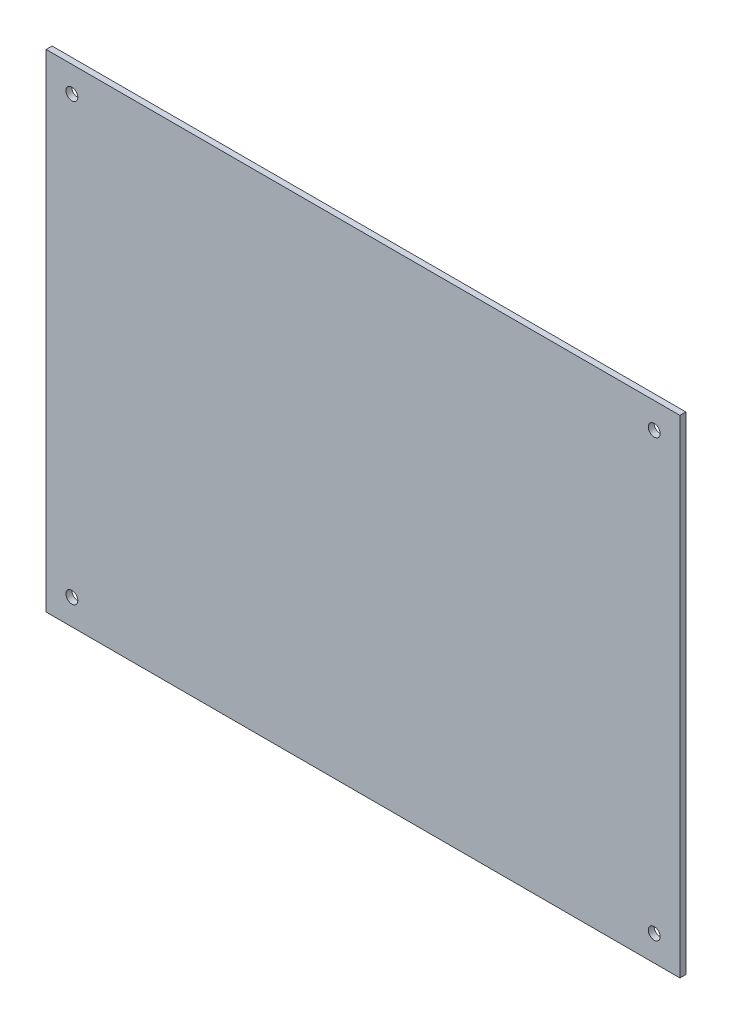
ISO-10303-21;
HEADER;
FILE_DESCRIPTION(('STEP AP214'),'2;1');
FILE_NAME('part.step','',(''),(''),'','','');
FILE_SCHEMA(('AUTOMOTIVE_DESIGN { 1 0 10303 214 1 1 1 1 }'));
ENDSEC;
DATA;
#1=APPLICATION_CONTEXT('core data for automotive mechanical design processes');
#2=APPLICATION_PROTOCOL_DEFINITION('international standard','automotive_design',2000,#1);
#3=PRODUCT_CONTEXT('',#1,'mechanical');
#4=PRODUCT('Part','Part','',(#3));
#5=PRODUCT_RELATED_PRODUCT_CATEGORY('part','',(#4));
#6=PRODUCT_DEFINITION_FORMATION('','',#4);
#7=PRODUCT_DEFINITION_CONTEXT('part definition',#1,'design');
#8=PRODUCT_DEFINITION('design','',#6,#7);
#9=PRODUCT_DEFINITION_SHAPE('','',#8);
#10=(LENGTH_UNIT() NAMED_UNIT(*) SI_UNIT(.MILLI.,.METRE.));
#11=(NAMED_UNIT(*) PLANE_ANGLE_UNIT() SI_UNIT($,.RADIAN.));
#12=(NAMED_UNIT(*) SI_UNIT($,.STERADIAN.) SOLID_ANGLE_UNIT());
#13=UNCERTAINTY_MEASURE_WITH_UNIT(LENGTH_MEASURE(1.E-05),#10,'distance_accuracy_value','');
#14=(GEOMETRIC_REPRESENTATION_CONTEXT(3) GLOBAL_UNCERTAINTY_ASSIGNED_CONTEXT((#13)) GLOBAL_UNIT_ASSIGNED_CONTEXT((#10,
#11,#12)) REPRESENTATION_CONTEXT('',''));
#15=CARTESIAN_POINT('',(0.,0.,0.));
#16=DIRECTION('',(0.,0.,1.));
#17=DIRECTION('',(1.,0.,0.));
#18=AXIS2_PLACEMENT_3D('',#15,#16,#17);
#19=CARTESIAN_POINT('',(1037.34751782577,-1519.02260067621,2.25));
#20=DIRECTION('',(0.,0.,1.));
#21=DIRECTION('',(1.,0.,0.));
#22=AXIS2_PLACEMENT_3D('',#19,#20,#21);
#23=PLANE('',#22);
#24=CARTESIAN_POINT('',(1079.10835313975,-1742.80288964024,2.25));
#25=DIRECTION('',(0.,0.,1.));
#26=DIRECTION('',(1.,0.,0.));
#27=AXIS2_PLACEMENT_3D('',#24,#25,#26);
#28=CIRCLE('',#27,1.49999999999995);
#29=CARTESIAN_POINT('',(1080.60835313975,-1742.80288964024,2.25));
#30=VERTEX_POINT('',#29);
#31=EDGE_CURVE('E105',#30,#30,#28,.T.);
#32=ORIENTED_EDGE('',*,*,#31,.F.);
#33=EDGE_LOOP('',(#32));
#34=FACE_BOUND('',#33,.T.);
#35=CARTESIAN_POINT('',(1079.10835313975,-1632.80288964024,2.25));
#36=DIRECTION('',(0.,0.,1.));
#37=DIRECTION('',(1.,0.,0.));
#38=AXIS2_PLACEMENT_3D('',#35,#36,#37);
#39=CIRCLE('',#38,1.49999999999995);
#40=CARTESIAN_POINT('',(1080.60835313975,-1632.80288964024,2.25));
#41=VERTEX_POINT('',#40);
#42=EDGE_CURVE('E100',#41,#41,#39,.T.);
#43=ORIENTED_EDGE('',*,*,#42,.F.);
#44=EDGE_LOOP('',(#43));
#45=FACE_BOUND('',#44,.T.);
#46=DIRECTION('',(0.,-1.,0.));
#47=VECTOR('',#46,1.);
#48=CARTESIAN_POINT('',(1072.60835313975,-1626.30288964024,2.25));
#49=LINE('',#48,#47);
#50=CARTESIAN_POINT('',(1072.60835313975,-1626.30288964024,2.25));
#51=VERTEX_POINT('',#50);
#52=CARTESIAN_POINT('',(1072.60835313975,-1749.30288964024,2.25));
#53=VERTEX_POINT('',#52);
#54=EDGE_CURVE('E93',#51,#53,#49,.T.);
#55=ORIENTED_EDGE('',*,*,#54,.T.);
#56=DIRECTION('',(1.,0.,0.));
#57=VECTOR('',#56,1.);
#58=CARTESIAN_POINT('',(1072.60835313975,-1749.30288964024,2.25));
#59=LINE('',#58,#57);
#60=CARTESIAN_POINT('',(1232.60835313975,-1749.30288964024,2.25));
#61=VERTEX_POINT('',#60);
#62=EDGE_CURVE('E125',#53,#61,#59,.T.);
#63=ORIENTED_EDGE('',*,*,#62,.T.);
#64=DIRECTION('',(0.,1.,0.));
#65=VECTOR('',#64,1.);
#66=CARTESIAN_POINT('',(1232.60835313975,-1626.30288964024,2.25));
#67=LINE('',#66,#65);
#68=CARTESIAN_POINT('',(1232.60835313975,-1626.30288964024,2.25));
#69=VERTEX_POINT('',#68);
#70=EDGE_CURVE('E87',#61,#69,#67,.T.);
#71=ORIENTED_EDGE('',*,*,#70,.T.);
#72=DIRECTION('',(-1.,0.,0.));
#73=VECTOR('',#72,1.);
#74=CARTESIAN_POINT('',(1072.60835313975,-1626.30288964024,2.25));
#75=LINE('',#74,#73);
#76=EDGE_CURVE('E53',#69,#51,#75,.T.);
#77=ORIENTED_EDGE('',*,*,#76,.T.);
#78=EDGE_LOOP('',(#55,#63,#71,#77));
#79=FACE_BOUND('',#78,.T.);
#80=CARTESIAN_POINT('',(1226.10835313975,-1742.80288964024,2.25));
#81=DIRECTION('',(0.,0.,1.));
#82=DIRECTION('',(1.,0.,0.));
#83=AXIS2_PLACEMENT_3D('',#80,#81,#82);
#84=CIRCLE('',#83,1.49999999999995);
#85=CARTESIAN_POINT('',(1227.60835313975,-1742.80288964024,2.25));
#86=VERTEX_POINT('',#85);
#87=EDGE_CURVE('E101',#86,#86,#84,.T.);
#88=ORIENTED_EDGE('',*,*,#87,.F.);
#89=EDGE_LOOP('',(#88));
#90=FACE_BOUND('',#89,.T.);
#91=CARTESIAN_POINT('',(1226.10835313975,-1632.80288964024,2.25));
#92=DIRECTION('',(0.,0.,1.));
#93=DIRECTION('',(1.,0.,0.));
#94=AXIS2_PLACEMENT_3D('',#91,#92,#93);
#95=CIRCLE('',#94,1.49999999999995);
#96=CARTESIAN_POINT('',(1227.60835313975,-1632.80288964024,2.25));
#97=VERTEX_POINT('',#96);
#98=EDGE_CURVE('E109',#97,#97,#95,.T.);
#99=ORIENTED_EDGE('',*,*,#98,.F.);
#100=EDGE_LOOP('',(#99));
#101=FACE_BOUND('',#100,.T.);
#102=ADVANCED_FACE('F34',(#34,#45,#79,#90,#101),#23,.T.);
#103=CARTESIAN_POINT('',(1037.34751782577,-1519.02260067621,0.75));
#104=DIRECTION('',(0.,0.,1.));
#105=DIRECTION('',(1.,0.,0.));
#106=AXIS2_PLACEMENT_3D('',#103,#104,#105);
#107=PLANE('',#106);
#108=DIRECTION('',(0.,-1.,0.));
#109=VECTOR('',#108,1.);
#110=CARTESIAN_POINT('',(1072.60835313975,-1626.30288964024,0.75));
#111=LINE('',#110,#109);
#112=CARTESIAN_POINT('',(1072.60835313975,-1626.30288964024,0.75));
#113=VERTEX_POINT('',#112);
#114=CARTESIAN_POINT('',(1072.60835313975,-1749.30288964024,0.75));
#115=VERTEX_POINT('',#114);
#116=EDGE_CURVE('E81',#113,#115,#111,.T.);
#117=ORIENTED_EDGE('',*,*,#116,.F.);
#118=DIRECTION('',(-1.,0.,0.));
#119=VECTOR('',#118,1.);
#120=CARTESIAN_POINT('',(1072.60835313975,-1626.30288964024,0.75));
#121=LINE('',#120,#119);
#122=CARTESIAN_POINT('',(1232.60835313975,-1626.30288964024,0.75));
#123=VERTEX_POINT('',#122);
#124=EDGE_CURVE('E91',#123,#113,#121,.T.);
#125=ORIENTED_EDGE('',*,*,#124,.F.);
#126=DIRECTION('',(0.,1.,0.));
#127=VECTOR('',#126,1.);
#128=CARTESIAN_POINT('',(1232.60835313975,-1626.30288964024,0.75));
#129=LINE('',#128,#127);
#130=CARTESIAN_POINT('',(1232.60835313975,-1749.30288964024,0.75));
#131=VERTEX_POINT('',#130);
#132=EDGE_CURVE('E80',#131,#123,#129,.T.);
#133=ORIENTED_EDGE('',*,*,#132,.F.);
#134=DIRECTION('',(1.,0.,0.));
#135=VECTOR('',#134,1.);
#136=CARTESIAN_POINT('',(1072.60835313975,-1749.30288964024,0.75));
#137=LINE('',#136,#135);
#138=EDGE_CURVE('E71',#115,#131,#137,.T.);
#139=ORIENTED_EDGE('',*,*,#138,.F.);
#140=EDGE_LOOP('',(#117,#125,#133,#139));
#141=FACE_BOUND('',#140,.T.);
#142=CARTESIAN_POINT('',(1079.10835313975,-1632.80288964024,0.75));
#143=DIRECTION('',(0.,0.,1.));
#144=DIRECTION('',(1.,0.,0.));
#145=AXIS2_PLACEMENT_3D('',#142,#143,#144);
#146=CIRCLE('',#145,1.49999999999995);
#147=CARTESIAN_POINT('',(1080.60835313975,-1632.80288964024,0.75));
#148=VERTEX_POINT('',#147);
#149=EDGE_CURVE('E97',#148,#148,#146,.T.);
#150=ORIENTED_EDGE('',*,*,#149,.T.);
#151=EDGE_LOOP('',(#150));
#152=FACE_BOUND('',#151,.T.);
#153=CARTESIAN_POINT('',(1226.10835313975,-1742.80288964024,0.75));
#154=DIRECTION('',(0.,0.,1.));
#155=DIRECTION('',(1.,0.,0.));
#156=AXIS2_PLACEMENT_3D('',#153,#154,#155);
#157=CIRCLE('',#156,1.49999999999995);
#158=CARTESIAN_POINT('',(1227.60835313975,-1742.80288964024,0.75));
#159=VERTEX_POINT('',#158);
#160=EDGE_CURVE('E102',#159,#159,#157,.T.);
#161=ORIENTED_EDGE('',*,*,#160,.T.);
#162=EDGE_LOOP('',(#161));
#163=FACE_BOUND('',#162,.T.);
#164=CARTESIAN_POINT('',(1079.10835313975,-1742.80288964024,0.75));
#165=DIRECTION('',(0.,0.,1.));
#166=DIRECTION('',(1.,0.,0.));
#167=AXIS2_PLACEMENT_3D('',#164,#165,#166);
#168=CIRCLE('',#167,1.49999999999995);
#169=CARTESIAN_POINT('',(1080.60835313975,-1742.80288964024,0.75));
#170=VERTEX_POINT('',#169);
#171=EDGE_CURVE('E106',#170,#170,#168,.T.);
#172=ORIENTED_EDGE('',*,*,#171,.T.);
#173=EDGE_LOOP('',(#172));
#174=FACE_BOUND('',#173,.T.);
#175=CARTESIAN_POINT('',(1226.10835313975,-1632.80288964024,0.75));
#176=DIRECTION('',(0.,0.,1.));
#177=DIRECTION('',(1.,0.,0.));
#178=AXIS2_PLACEMENT_3D('',#175,#176,#177);
#179=CIRCLE('',#178,1.49999999999995);
#180=CARTESIAN_POINT('',(1227.60835313975,-1632.80288964024,0.75));
#181=VERTEX_POINT('',#180);
#182=EDGE_CURVE('E110',#181,#181,#179,.T.);
#183=ORIENTED_EDGE('',*,*,#182,.T.);
#184=EDGE_LOOP('',(#183));
#185=FACE_BOUND('',#184,.T.);
#186=ADVANCED_FACE('F89',(#141,#152,#163,#174,#185),#107,.F.);
#187=CARTESIAN_POINT('',(1072.60835313975,-1626.30288964024,2.25));
#188=DIRECTION('',(1.,0.,0.));
#189=DIRECTION('',(0.,1.,0.));
#190=AXIS2_PLACEMENT_3D('',#187,#188,#189);
#191=PLANE('',#190);
#192=ORIENTED_EDGE('',*,*,#116,.T.);
#193=DIRECTION('',(0.,0.,-1.));
#194=VECTOR('',#193,1.);
#195=CARTESIAN_POINT('',(1072.60835313975,-1749.30288964024,2.25));
#196=LINE('',#195,#194);
#197=EDGE_CURVE('E11',#53,#115,#196,.T.);
#198=ORIENTED_EDGE('',*,*,#197,.F.);
#199=ORIENTED_EDGE('',*,*,#54,.F.);
#200=DIRECTION('',(0.,0.,-1.));
#201=VECTOR('',#200,1.);
#202=CARTESIAN_POINT('',(1072.60835313975,-1626.30288964024,2.25));
#203=LINE('',#202,#201);
#204=EDGE_CURVE('E121',#51,#113,#203,.T.);
#205=ORIENTED_EDGE('',*,*,#204,.T.);
#206=EDGE_LOOP('',(#192,#198,#199,#205));
#207=FACE_BOUND('',#206,.T.);
#208=ADVANCED_FACE('F157',(#207),#191,.F.);
#209=CARTESIAN_POINT('',(1072.60835313975,-1749.30288964024,2.25));
#210=DIRECTION('',(0.,1.,0.));
#211=DIRECTION('',(0.,0.,1.));
#212=AXIS2_PLACEMENT_3D('',#209,#210,#211);
#213=PLANE('',#212);
#214=ORIENTED_EDGE('',*,*,#138,.T.);
#215=DIRECTION('',(0.,0.,-1.));
#216=VECTOR('',#215,1.);
#217=CARTESIAN_POINT('',(1232.60835313975,-1749.30288964024,2.25));
#218=LINE('',#217,#216);
#219=EDGE_CURVE('E44',#61,#131,#218,.T.);
#220=ORIENTED_EDGE('',*,*,#219,.F.);
#221=ORIENTED_EDGE('',*,*,#62,.F.);
#222=ORIENTED_EDGE('',*,*,#197,.T.);
#223=EDGE_LOOP('',(#214,#220,#221,#222));
#224=FACE_BOUND('',#223,.T.);
#225=ADVANCED_FACE('F75',(#224),#213,.F.);
#226=CARTESIAN_POINT('',(1232.60835313975,-1626.30288964024,2.25));
#227=DIRECTION('',(-1.,0.,0.));
#228=DIRECTION('',(0.,0.,1.));
#229=AXIS2_PLACEMENT_3D('',#226,#227,#228);
#230=PLANE('',#229);
#231=ORIENTED_EDGE('',*,*,#132,.T.);
#232=DIRECTION('',(0.,0.,-1.));
#233=VECTOR('',#232,1.);
#234=CARTESIAN_POINT('',(1232.60835313975,-1626.30288964024,2.25));
#235=LINE('',#234,#233);
#236=EDGE_CURVE('E38',#69,#123,#235,.T.);
#237=ORIENTED_EDGE('',*,*,#236,.F.);
#238=ORIENTED_EDGE('',*,*,#70,.F.);
#239=ORIENTED_EDGE('',*,*,#219,.T.);
#240=EDGE_LOOP('',(#231,#237,#238,#239));
#241=FACE_BOUND('',#240,.T.);
#242=ADVANCED_FACE('F84',(#241),#230,.F.);
#243=CARTESIAN_POINT('',(1072.60835313975,-1626.30288964024,2.25));
#244=DIRECTION('',(0.,-1.,0.));
#245=DIRECTION('',(0.,0.,-1.));
#246=AXIS2_PLACEMENT_3D('',#243,#244,#245);
#247=PLANE('',#246);
#248=ORIENTED_EDGE('',*,*,#124,.T.);
#249=ORIENTED_EDGE('',*,*,#204,.F.);
#250=ORIENTED_EDGE('',*,*,#76,.F.);
#251=ORIENTED_EDGE('',*,*,#236,.T.);
#252=EDGE_LOOP('',(#248,#249,#250,#251));
#253=FACE_BOUND('',#252,.T.);
#254=ADVANCED_FACE('F167',(#253),#247,.F.);
#255=CARTESIAN_POINT('',(1079.10835313975,-1632.80288964024,2.25));
#256=DIRECTION('',(0.,0.,-1.));
#257=DIRECTION('',(-1.,0.,0.));
#258=AXIS2_PLACEMENT_3D('',#255,#256,#257);
#259=CYLINDRICAL_SURFACE('',#258,1.49999999999995);
#260=ORIENTED_EDGE('',*,*,#42,.T.);
#261=EDGE_LOOP('',(#260));
#262=FACE_BOUND('',#261,.T.);
#263=ORIENTED_EDGE('',*,*,#149,.F.);
#264=EDGE_LOOP('',(#263));
#265=FACE_BOUND('',#264,.T.);
#266=ADVANCED_FACE('F151',(#262,#265),#259,.F.);
#267=CARTESIAN_POINT('',(1226.10835313975,-1742.80288964024,2.25));
#268=DIRECTION('',(0.,0.,-1.));
#269=DIRECTION('',(-1.,0.,0.));
#270=AXIS2_PLACEMENT_3D('',#267,#268,#269);
#271=CYLINDRICAL_SURFACE('',#270,1.49999999999995);
#272=ORIENTED_EDGE('',*,*,#87,.T.);
#273=EDGE_LOOP('',(#272));
#274=FACE_BOUND('',#273,.T.);
#275=ORIENTED_EDGE('',*,*,#160,.F.);
#276=EDGE_LOOP('',(#275));
#277=FACE_BOUND('',#276,.T.);
#278=ADVANCED_FACE('F148',(#274,#277),#271,.F.);
#279=CARTESIAN_POINT('',(1079.10835313975,-1742.80288964024,2.25));
#280=DIRECTION('',(0.,0.,-1.));
#281=DIRECTION('',(-1.,0.,0.));
#282=AXIS2_PLACEMENT_3D('',#279,#280,#281);
#283=CYLINDRICAL_SURFACE('',#282,1.49999999999995);
#284=ORIENTED_EDGE('',*,*,#31,.T.);
#285=EDGE_LOOP('',(#284));
#286=FACE_BOUND('',#285,.T.);
#287=ORIENTED_EDGE('',*,*,#171,.F.);
#288=EDGE_LOOP('',(#287));
#289=FACE_BOUND('',#288,.T.);
#290=ADVANCED_FACE('F136',(#286,#289),#283,.F.);
#291=CARTESIAN_POINT('',(1226.10835313975,-1632.80288964024,2.25));
#292=DIRECTION('',(0.,0.,-1.));
#293=DIRECTION('',(-1.,0.,0.));
#294=AXIS2_PLACEMENT_3D('',#291,#292,#293);
#295=CYLINDRICAL_SURFACE('',#294,1.49999999999995);
#296=ORIENTED_EDGE('',*,*,#98,.T.);
#297=EDGE_LOOP('',(#296));
#298=FACE_BOUND('',#297,.T.);
#299=ORIENTED_EDGE('',*,*,#182,.F.);
#300=EDGE_LOOP('',(#299));
#301=FACE_BOUND('',#300,.T.);
#302=ADVANCED_FACE('F36',(#298,#301),#295,.F.);
#303=CLOSED_SHELL('',(#102,#186,#208,#225,#242,#254,#266,#278,#290,#302));
#304=MANIFOLD_SOLID_BREP('B2',#303);
#305=ADVANCED_BREP_SHAPE_REPRESENTATION('',(#18,#304),#14);
#306=SHAPE_DEFINITION_REPRESENTATION(#9,#305);
ENDSEC;
END-ISO-10303-21;
